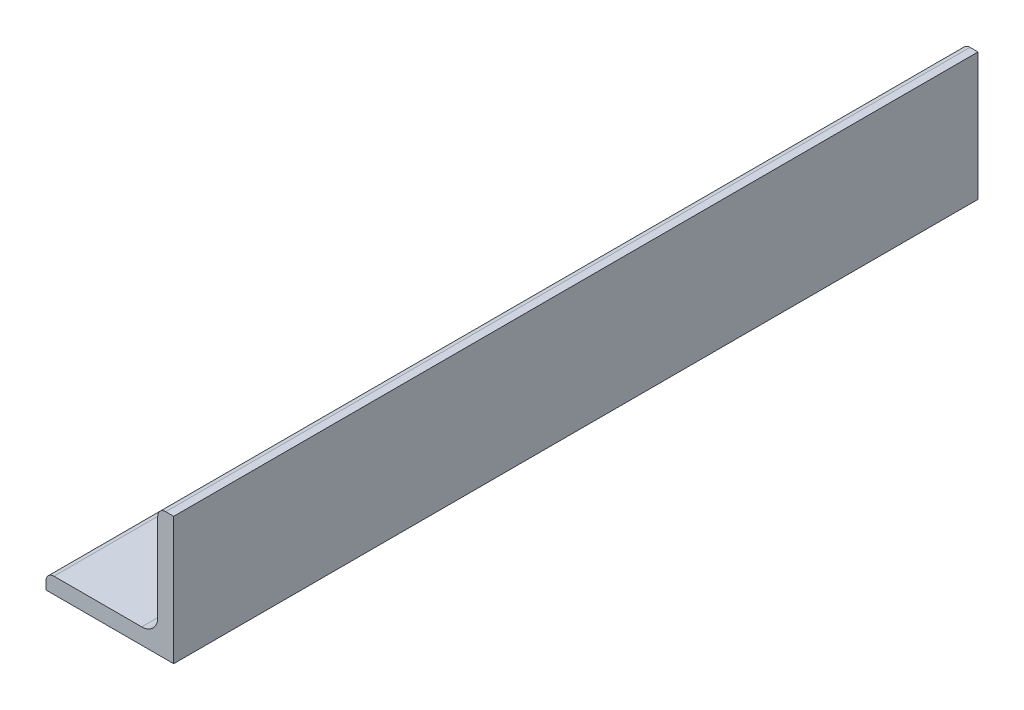
ISO-10303-21;
HEADER;
FILE_DESCRIPTION(('STEP AP214'),'2;1');
FILE_NAME('part.step','',(''),(''),'','','');
FILE_SCHEMA(('AUTOMOTIVE_DESIGN { 1 0 10303 214 1 1 1 1 }'));
ENDSEC;
DATA;
#1=APPLICATION_CONTEXT('core data for automotive mechanical design processes');
#2=APPLICATION_PROTOCOL_DEFINITION('international standard','automotive_design',2000,#1);
#3=PRODUCT_CONTEXT('',#1,'mechanical');
#4=PRODUCT('Part','Part','',(#3));
#5=PRODUCT_RELATED_PRODUCT_CATEGORY('part','',(#4));
#6=PRODUCT_DEFINITION_FORMATION('','',#4);
#7=PRODUCT_DEFINITION_CONTEXT('part definition',#1,'design');
#8=PRODUCT_DEFINITION('design','',#6,#7);
#9=PRODUCT_DEFINITION_SHAPE('','',#8);
#10=(LENGTH_UNIT() NAMED_UNIT(*) SI_UNIT(.MILLI.,.METRE.));
#11=(NAMED_UNIT(*) PLANE_ANGLE_UNIT() SI_UNIT($,.RADIAN.));
#12=(NAMED_UNIT(*) SI_UNIT($,.STERADIAN.) SOLID_ANGLE_UNIT());
#13=UNCERTAINTY_MEASURE_WITH_UNIT(LENGTH_MEASURE(1.E-05),#10,'distance_accuracy_value','');
#14=(GEOMETRIC_REPRESENTATION_CONTEXT(3) GLOBAL_UNCERTAINTY_ASSIGNED_CONTEXT((#13)) GLOBAL_UNIT_ASSIGNED_CONTEXT((#10,
#11,#12)) REPRESENTATION_CONTEXT('',''));
#15=CARTESIAN_POINT('',(0.,0.,0.));
#16=DIRECTION('',(0.,0.,1.));
#17=DIRECTION('',(1.,0.,0.));
#18=AXIS2_PLACEMENT_3D('',#15,#16,#17);
#19=CARTESIAN_POINT('',(-12.7,-11.1125,609.6));
#20=DIRECTION('',(1.,0.,0.));
#21=DIRECTION('',(0.,0.,-1.));
#22=AXIS2_PLACEMENT_3D('',#19,#20,#21);
#23=PLANE('',#22);
#24=DIRECTION('',(0.,0.,-1.));
#25=VECTOR('',#24,1.);
#26=CARTESIAN_POINT('',(-12.7,-11.1125,609.6));
#27=LINE('',#26,#25);
#28=CARTESIAN_POINT('',(-12.7,-11.1125,609.6));
#29=VERTEX_POINT('',#28);
#30=CARTESIAN_POINT('',(-12.7,-11.1125,449.6));
#31=VERTEX_POINT('',#30);
#32=EDGE_CURVE('E149',#29,#31,#27,.T.);
#33=ORIENTED_EDGE('',*,*,#32,.T.);
#34=DIRECTION('',(0.,-1.,0.));
#35=VECTOR('',#34,1.);
#36=CARTESIAN_POINT('',(-12.7,-11.1124999999993,449.6));
#37=LINE('',#36,#35);
#38=CARTESIAN_POINT('',(-12.7,-12.7,449.6));
#39=VERTEX_POINT('',#38);
#40=EDGE_CURVE('E55',#31,#39,#37,.T.);
#41=ORIENTED_EDGE('',*,*,#40,.T.);
#42=DIRECTION('',(0.,0.,-1.));
#43=VECTOR('',#42,1.);
#44=CARTESIAN_POINT('',(-12.7,-12.7,609.6));
#45=LINE('',#44,#43);
#46=CARTESIAN_POINT('',(-12.7,-12.7,609.6));
#47=VERTEX_POINT('',#46);
#48=EDGE_CURVE('E48',#47,#39,#45,.T.);
#49=ORIENTED_EDGE('',*,*,#48,.F.);
#50=DIRECTION('',(0.,-1.,0.));
#51=VECTOR('',#50,1.);
#52=CARTESIAN_POINT('',(-12.7,-11.1125,609.6));
#53=LINE('',#52,#51);
#54=EDGE_CURVE('E148',#29,#47,#53,.T.);
#55=ORIENTED_EDGE('',*,*,#54,.F.);
#56=EDGE_LOOP('',(#33,#41,#49,#55));
#57=FACE_BOUND('',#56,.T.);
#58=ADVANCED_FACE('F41',(#57),#23,.F.);
#59=CARTESIAN_POINT('',(-12.7,-12.7,609.6));
#60=DIRECTION('',(0.,1.,0.));
#61=DIRECTION('',(-1.,0.,0.));
#62=AXIS2_PLACEMENT_3D('',#59,#60,#61);
#63=PLANE('',#62);
#64=ORIENTED_EDGE('',*,*,#48,.T.);
#65=DIRECTION('',(1.,0.,0.));
#66=VECTOR('',#65,1.);
#67=CARTESIAN_POINT('',(-17.78,-12.7,449.6));
#68=LINE('',#67,#66);
#69=CARTESIAN_POINT('',(12.7,-12.7,449.6));
#70=VERTEX_POINT('',#69);
#71=EDGE_CURVE('E120',#39,#70,#68,.T.);
#72=ORIENTED_EDGE('',*,*,#71,.T.);
#73=DIRECTION('',(0.,0.,-1.));
#74=VECTOR('',#73,1.);
#75=CARTESIAN_POINT('',(12.7,-12.7,609.6));
#76=LINE('',#75,#74);
#77=CARTESIAN_POINT('',(12.7,-12.7,609.6));
#78=VERTEX_POINT('',#77);
#79=EDGE_CURVE('E130',#78,#70,#76,.T.);
#80=ORIENTED_EDGE('',*,*,#79,.F.);
#81=DIRECTION('',(1.,0.,0.));
#82=VECTOR('',#81,1.);
#83=CARTESIAN_POINT('',(-12.7,-12.7,609.6));
#84=LINE('',#83,#82);
#85=EDGE_CURVE('E144',#47,#78,#84,.T.);
#86=ORIENTED_EDGE('',*,*,#85,.F.);
#87=EDGE_LOOP('',(#64,#72,#80,#86));
#88=FACE_BOUND('',#87,.T.);
#89=ADVANCED_FACE('F143',(#88),#63,.F.);
#90=CARTESIAN_POINT('',(12.7,-12.7,609.6));
#91=DIRECTION('',(-1.,0.,0.));
#92=DIRECTION('',(0.,-1.,0.));
#93=AXIS2_PLACEMENT_3D('',#90,#91,#92);
#94=PLANE('',#93);
#95=ORIENTED_EDGE('',*,*,#79,.T.);
#96=DIRECTION('',(0.,-1.,0.));
#97=VECTOR('',#96,1.);
#98=CARTESIAN_POINT('',(12.7,12.6999999999999,449.6));
#99=LINE('',#98,#97);
#100=CARTESIAN_POINT('',(12.7,12.6999999999999,449.6));
#101=VERTEX_POINT('',#100);
#102=EDGE_CURVE('E112',#101,#70,#99,.T.);
#103=ORIENTED_EDGE('',*,*,#102,.F.);
#104=DIRECTION('',(0.,0.,-1.));
#105=VECTOR('',#104,1.);
#106=CARTESIAN_POINT('',(12.7,12.7,609.6));
#107=LINE('',#106,#105);
#108=CARTESIAN_POINT('',(12.7,12.7,609.6));
#109=VERTEX_POINT('',#108);
#110=EDGE_CURVE('E127',#109,#101,#107,.T.);
#111=ORIENTED_EDGE('',*,*,#110,.F.);
#112=DIRECTION('',(0.,1.,0.));
#113=VECTOR('',#112,1.);
#114=CARTESIAN_POINT('',(12.7,-12.7,609.6));
#115=LINE('',#114,#113);
#116=EDGE_CURVE('E157',#78,#109,#115,.T.);
#117=ORIENTED_EDGE('',*,*,#116,.F.);
#118=EDGE_LOOP('',(#95,#103,#111,#117));
#119=FACE_BOUND('',#118,.T.);
#120=ADVANCED_FACE('F125',(#119),#94,.F.);
#121=CARTESIAN_POINT('',(11.1125,12.7,609.6));
#122=DIRECTION('',(0.,-1.,0.));
#123=DIRECTION('',(0.,0.,-1.));
#124=AXIS2_PLACEMENT_3D('',#121,#122,#123);
#125=PLANE('',#124);
#126=ORIENTED_EDGE('',*,*,#110,.T.);
#127=DIRECTION('',(1.,0.,0.));
#128=VECTOR('',#127,1.);
#129=CARTESIAN_POINT('',(-17.78,12.6999999999999,449.6));
#130=LINE('',#129,#128);
#131=CARTESIAN_POINT('',(11.1125,12.6999999999999,449.6));
#132=VERTEX_POINT('',#131);
#133=EDGE_CURVE('E109',#132,#101,#130,.T.);
#134=ORIENTED_EDGE('',*,*,#133,.F.);
#135=DIRECTION('',(0.,0.,-1.));
#136=VECTOR('',#135,1.);
#137=CARTESIAN_POINT('',(11.1125,12.7,609.6));
#138=LINE('',#137,#136);
#139=CARTESIAN_POINT('',(11.1125,12.7,609.6));
#140=VERTEX_POINT('',#139);
#141=EDGE_CURVE('E134',#140,#132,#138,.T.);
#142=ORIENTED_EDGE('',*,*,#141,.F.);
#143=DIRECTION('',(-1.,0.,0.));
#144=VECTOR('',#143,1.);
#145=CARTESIAN_POINT('',(11.1125,12.7,609.6));
#146=LINE('',#145,#144);
#147=EDGE_CURVE('E133',#109,#140,#146,.T.);
#148=ORIENTED_EDGE('',*,*,#147,.F.);
#149=EDGE_LOOP('',(#126,#134,#142,#148));
#150=FACE_BOUND('',#149,.T.);
#151=ADVANCED_FACE('F132',(#150),#125,.F.);
#152=CARTESIAN_POINT('',(11.1125,11.1125,609.6));
#153=DIRECTION('',(0.,0.,-1.));
#154=DIRECTION('',(-1.,0.,0.));
#155=AXIS2_PLACEMENT_3D('',#152,#153,#154);
#156=CYLINDRICAL_SURFACE('',#155,1.5875);
#157=ORIENTED_EDGE('',*,*,#141,.T.);
#158=CARTESIAN_POINT('',(11.1125,11.1125,449.6));
#159=DIRECTION('',(0.,0.,1.));
#160=DIRECTION('',(0.,-1.,0.));
#161=AXIS2_PLACEMENT_3D('',#158,#159,#160);
#162=CIRCLE('',#161,1.5875);
#163=CARTESIAN_POINT('',(9.525,11.1125,449.6));
#164=VERTEX_POINT('',#163);
#165=EDGE_CURVE('E115',#132,#164,#162,.T.);
#166=ORIENTED_EDGE('',*,*,#165,.T.);
#167=DIRECTION('',(0.,0.,-1.));
#168=VECTOR('',#167,1.);
#169=CARTESIAN_POINT('',(9.525,11.1125,609.6));
#170=LINE('',#169,#168);
#171=CARTESIAN_POINT('',(9.525,11.1125,609.6));
#172=VERTEX_POINT('',#171);
#173=EDGE_CURVE('E137',#172,#164,#170,.T.);
#174=ORIENTED_EDGE('',*,*,#173,.F.);
#175=CARTESIAN_POINT('',(11.1125,11.1125,609.6));
#176=DIRECTION('',(0.,0.,1.));
#177=DIRECTION('',(-1.,0.,0.));
#178=AXIS2_PLACEMENT_3D('',#175,#176,#177);
#179=CIRCLE('',#178,1.5875);
#180=EDGE_CURVE('E160',#140,#172,#179,.T.);
#181=ORIENTED_EDGE('',*,*,#180,.F.);
#182=EDGE_LOOP('',(#157,#166,#174,#181));
#183=FACE_BOUND('',#182,.T.);
#184=ADVANCED_FACE('F187',(#183),#156,.T.);
#185=CARTESIAN_POINT('',(9.525,11.1125,609.6));
#186=DIRECTION('',(1.,0.,0.));
#187=DIRECTION('',(0.,1.,0.));
#188=AXIS2_PLACEMENT_3D('',#185,#186,#187);
#189=PLANE('',#188);
#190=ORIENTED_EDGE('',*,*,#173,.T.);
#191=DIRECTION('',(0.,-1.,0.));
#192=VECTOR('',#191,1.);
#193=CARTESIAN_POINT('',(9.525,11.1125000000007,449.6));
#194=LINE('',#193,#192);
#195=CARTESIAN_POINT('',(9.525,-6.35,449.6));
#196=VERTEX_POINT('',#195);
#197=EDGE_CURVE('E152',#164,#196,#194,.T.);
#198=ORIENTED_EDGE('',*,*,#197,.T.);
#199=DIRECTION('',(0.,0.,-1.));
#200=VECTOR('',#199,1.);
#201=CARTESIAN_POINT('',(9.525,-6.35,609.6));
#202=LINE('',#201,#200);
#203=CARTESIAN_POINT('',(9.525,-6.35,609.6));
#204=VERTEX_POINT('',#203);
#205=EDGE_CURVE('E176',#204,#196,#202,.T.);
#206=ORIENTED_EDGE('',*,*,#205,.F.);
#207=DIRECTION('',(0.,-1.,0.));
#208=VECTOR('',#207,1.);
#209=CARTESIAN_POINT('',(9.525,11.1125,609.6));
#210=LINE('',#209,#208);
#211=EDGE_CURVE('E162',#172,#204,#210,.T.);
#212=ORIENTED_EDGE('',*,*,#211,.F.);
#213=EDGE_LOOP('',(#190,#198,#206,#212));
#214=FACE_BOUND('',#213,.T.);
#215=ADVANCED_FACE('F183',(#214),#189,.F.);
#216=CARTESIAN_POINT('',(6.35,-6.35,609.6));
#217=DIRECTION('',(0.,0.,-1.));
#218=DIRECTION('',(-1.,0.,0.));
#219=AXIS2_PLACEMENT_3D('',#216,#217,#218);
#220=CYLINDRICAL_SURFACE('',#219,3.175);
#221=ORIENTED_EDGE('',*,*,#205,.T.);
#222=CARTESIAN_POINT('',(6.35,-6.35,449.6));
#223=DIRECTION('',(0.,0.,1.));
#224=DIRECTION('',(0.,-1.,0.));
#225=AXIS2_PLACEMENT_3D('',#222,#223,#224);
#226=CIRCLE('',#225,3.175);
#227=CARTESIAN_POINT('',(6.35,-9.525,449.6));
#228=VERTEX_POINT('',#227);
#229=EDGE_CURVE('E195',#196,#228,#226,.F.);
#230=ORIENTED_EDGE('',*,*,#229,.T.);
#231=DIRECTION('',(0.,0.,-1.));
#232=VECTOR('',#231,1.);
#233=CARTESIAN_POINT('',(6.35,-9.525,609.6));
#234=LINE('',#233,#232);
#235=CARTESIAN_POINT('',(6.35,-9.525,609.6));
#236=VERTEX_POINT('',#235);
#237=EDGE_CURVE('E173',#236,#228,#234,.T.);
#238=ORIENTED_EDGE('',*,*,#237,.F.);
#239=CARTESIAN_POINT('',(6.35,-6.35,609.6));
#240=DIRECTION('',(0.,0.,-1.));
#241=DIRECTION('',(-1.,0.,0.));
#242=AXIS2_PLACEMENT_3D('',#239,#240,#241);
#243=CIRCLE('',#242,3.175);
#244=EDGE_CURVE('E164',#204,#236,#243,.T.);
#245=ORIENTED_EDGE('',*,*,#244,.F.);
#246=EDGE_LOOP('',(#221,#230,#238,#245));
#247=FACE_BOUND('',#246,.T.);
#248=ADVANCED_FACE('F193',(#247),#220,.F.);
#249=CARTESIAN_POINT('',(6.35,-9.525,609.6));
#250=DIRECTION('',(0.,-1.,0.));
#251=DIRECTION('',(1.,0.,0.));
#252=AXIS2_PLACEMENT_3D('',#249,#250,#251);
#253=PLANE('',#252);
#254=ORIENTED_EDGE('',*,*,#237,.T.);
#255=DIRECTION('',(-1.,0.,0.));
#256=VECTOR('',#255,1.);
#257=CARTESIAN_POINT('',(6.35,-9.525,449.6));
#258=LINE('',#257,#256);
#259=CARTESIAN_POINT('',(-11.1125,-9.525,449.6));
#260=VERTEX_POINT('',#259);
#261=EDGE_CURVE('E200',#228,#260,#258,.T.);
#262=ORIENTED_EDGE('',*,*,#261,.T.);
#263=DIRECTION('',(0.,0.,-1.));
#264=VECTOR('',#263,1.);
#265=CARTESIAN_POINT('',(-11.1125,-9.525,609.6));
#266=LINE('',#265,#264);
#267=CARTESIAN_POINT('',(-11.1125,-9.525,609.6));
#268=VERTEX_POINT('',#267);
#269=EDGE_CURVE('E170',#268,#260,#266,.T.);
#270=ORIENTED_EDGE('',*,*,#269,.F.);
#271=DIRECTION('',(-1.,0.,0.));
#272=VECTOR('',#271,1.);
#273=CARTESIAN_POINT('',(6.35,-9.525,609.6));
#274=LINE('',#273,#272);
#275=EDGE_CURVE('E166',#236,#268,#274,.T.);
#276=ORIENTED_EDGE('',*,*,#275,.F.);
#277=EDGE_LOOP('',(#254,#262,#270,#276));
#278=FACE_BOUND('',#277,.T.);
#279=ADVANCED_FACE('F199',(#278),#253,.F.);
#280=CARTESIAN_POINT('',(-11.1125,-11.1125,609.6));
#281=DIRECTION('',(0.,0.,-1.));
#282=DIRECTION('',(-1.,0.,0.));
#283=AXIS2_PLACEMENT_3D('',#280,#281,#282);
#284=CYLINDRICAL_SURFACE('',#283,1.5875);
#285=ORIENTED_EDGE('',*,*,#269,.T.);
#286=CARTESIAN_POINT('',(-11.1125,-11.1125,449.6));
#287=DIRECTION('',(0.,0.,1.));
#288=DIRECTION('',(0.,-1.,0.));
#289=AXIS2_PLACEMENT_3D('',#286,#287,#288);
#290=CIRCLE('',#289,1.5875);
#291=EDGE_CURVE('E11',#260,#31,#290,.T.);
#292=ORIENTED_EDGE('',*,*,#291,.T.);
#293=ORIENTED_EDGE('',*,*,#32,.F.);
#294=CARTESIAN_POINT('',(-11.1125,-11.1125,609.6));
#295=DIRECTION('',(0.,0.,1.));
#296=DIRECTION('',(-1.,0.,0.));
#297=AXIS2_PLACEMENT_3D('',#294,#295,#296);
#298=CIRCLE('',#297,1.5875);
#299=EDGE_CURVE('E62',#268,#29,#298,.T.);
#300=ORIENTED_EDGE('',*,*,#299,.F.);
#301=EDGE_LOOP('',(#285,#292,#293,#300));
#302=FACE_BOUND('',#301,.T.);
#303=ADVANCED_FACE('F202',(#302),#284,.T.);
#304=CARTESIAN_POINT('',(11.1125,11.1125,609.6));
#305=DIRECTION('',(0.,0.,-1.));
#306=DIRECTION('',(-1.,0.,0.));
#307=AXIS2_PLACEMENT_3D('',#304,#305,#306);
#308=PLANE('',#307);
#309=ORIENTED_EDGE('',*,*,#54,.T.);
#310=ORIENTED_EDGE('',*,*,#85,.T.);
#311=ORIENTED_EDGE('',*,*,#116,.T.);
#312=ORIENTED_EDGE('',*,*,#147,.T.);
#313=ORIENTED_EDGE('',*,*,#180,.T.);
#314=ORIENTED_EDGE('',*,*,#211,.T.);
#315=ORIENTED_EDGE('',*,*,#244,.T.);
#316=ORIENTED_EDGE('',*,*,#275,.T.);
#317=ORIENTED_EDGE('',*,*,#299,.T.);
#318=EDGE_LOOP('',(#309,#310,#311,#312,#313,#314,#315,#316,#317));
#319=FACE_BOUND('',#318,.T.);
#320=ADVANCED_FACE('F188',(#319),#308,.F.);
#321=CARTESIAN_POINT('',(-17.78,12.6999999999999,449.6));
#322=DIRECTION('',(0.,0.,1.));
#323=DIRECTION('',(0.,-1.,0.));
#324=AXIS2_PLACEMENT_3D('',#321,#322,#323);
#325=PLANE('',#324);
#326=ORIENTED_EDGE('',*,*,#291,.F.);
#327=ORIENTED_EDGE('',*,*,#261,.F.);
#328=ORIENTED_EDGE('',*,*,#229,.F.);
#329=ORIENTED_EDGE('',*,*,#197,.F.);
#330=ORIENTED_EDGE('',*,*,#165,.F.);
#331=ORIENTED_EDGE('',*,*,#133,.T.);
#332=ORIENTED_EDGE('',*,*,#102,.T.);
#333=ORIENTED_EDGE('',*,*,#71,.F.);
#334=ORIENTED_EDGE('',*,*,#40,.F.);
#335=EDGE_LOOP('',(#326,#327,#328,#329,#330,#331,#332,#333,#334));
#336=FACE_BOUND('',#335,.T.);
#337=ADVANCED_FACE('F111',(#336),#325,.F.);
#338=CLOSED_SHELL('',(#58,#89,#120,#151,#184,#215,#248,#279,#303,#320,#337));
#339=MANIFOLD_SOLID_BREP('B2',#338);
#340=ADVANCED_BREP_SHAPE_REPRESENTATION('',(#18,#339),#14);
#341=SHAPE_DEFINITION_REPRESENTATION(#9,#340);
ENDSEC;
END-ISO-10303-21;
